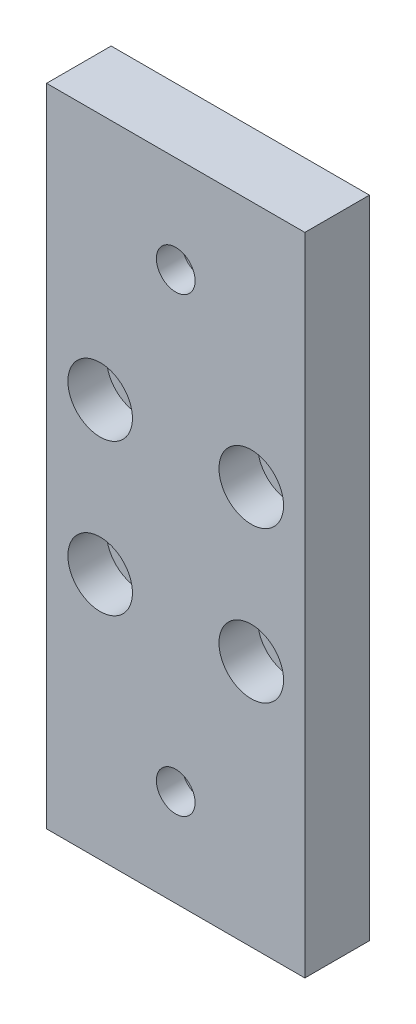
ISO-10303-21;
HEADER;
FILE_DESCRIPTION(('STEP AP214'),'2;1');
FILE_NAME('part.step','',(''),(''),'','','');
FILE_SCHEMA(('AUTOMOTIVE_DESIGN { 1 0 10303 214 1 1 1 1 }'));
ENDSEC;
DATA;
#1=APPLICATION_CONTEXT('core data for automotive mechanical design processes');
#2=APPLICATION_PROTOCOL_DEFINITION('international standard','automotive_design',2000,#1);
#3=PRODUCT_CONTEXT('',#1,'mechanical');
#4=PRODUCT('Part','Part','',(#3));
#5=PRODUCT_RELATED_PRODUCT_CATEGORY('part','',(#4));
#6=PRODUCT_DEFINITION_FORMATION('','',#4);
#7=PRODUCT_DEFINITION_CONTEXT('part definition',#1,'design');
#8=PRODUCT_DEFINITION('design','',#6,#7);
#9=PRODUCT_DEFINITION_SHAPE('','',#8);
#10=(LENGTH_UNIT() NAMED_UNIT(*) SI_UNIT(.MILLI.,.METRE.));
#11=(NAMED_UNIT(*) PLANE_ANGLE_UNIT() SI_UNIT($,.RADIAN.));
#12=(NAMED_UNIT(*) SI_UNIT($,.STERADIAN.) SOLID_ANGLE_UNIT());
#13=UNCERTAINTY_MEASURE_WITH_UNIT(LENGTH_MEASURE(1.E-05),#10,'distance_accuracy_value','');
#14=(GEOMETRIC_REPRESENTATION_CONTEXT(3) GLOBAL_UNCERTAINTY_ASSIGNED_CONTEXT((#13)) GLOBAL_UNIT_ASSIGNED_CONTEXT((#10,
#11,#12)) REPRESENTATION_CONTEXT('',''));
#15=CARTESIAN_POINT('',(0.,0.,0.));
#16=DIRECTION('',(0.,0.,1.));
#17=DIRECTION('',(1.,0.,0.));
#18=AXIS2_PLACEMENT_3D('',#15,#16,#17);
#19=CARTESIAN_POINT('',(31.7,61.7,-30.));
#20=DIRECTION('',(0.,0.,1.));
#21=DIRECTION('',(1.,0.,0.));
#22=AXIS2_PLACEMENT_3D('',#19,#20,#21);
#23=CYLINDRICAL_SURFACE('',#22,2.5);
#24=CARTESIAN_POINT('',(31.7,61.7,0.));
#25=DIRECTION('',(0.,0.,1.));
#26=DIRECTION('',(1.,0.,0.));
#27=AXIS2_PLACEMENT_3D('',#24,#25,#26);
#28=CIRCLE('',#27,2.5);
#29=CARTESIAN_POINT('',(34.2,61.7,0.));
#30=VERTEX_POINT('',#29);
#31=EDGE_CURVE('E132',#30,#30,#28,.T.);
#32=ORIENTED_EDGE('',*,*,#31,.F.);
#33=EDGE_LOOP('',(#32));
#34=FACE_BOUND('',#33,.T.);
#35=CARTESIAN_POINT('',(31.7,61.7,4.));
#36=DIRECTION('',(0.,0.,1.));
#37=DIRECTION('',(1.,0.,0.));
#38=AXIS2_PLACEMENT_3D('',#35,#36,#37);
#39=CIRCLE('',#38,2.5);
#40=CARTESIAN_POINT('',(34.2,61.7,4.));
#41=VERTEX_POINT('',#40);
#42=EDGE_CURVE('E49',#41,#41,#39,.F.);
#43=ORIENTED_EDGE('',*,*,#42,.F.);
#44=EDGE_LOOP('',(#43));
#45=FACE_BOUND('',#44,.T.);
#46=ADVANCED_FACE('F45',(#34,#45),#23,.F.);
#47=CARTESIAN_POINT('',(8.30000000000001,38.3,-30.));
#48=DIRECTION('',(0.,0.,1.));
#49=DIRECTION('',(1.,0.,0.));
#50=AXIS2_PLACEMENT_3D('',#47,#48,#49);
#51=CYLINDRICAL_SURFACE('',#50,2.5);
#52=CARTESIAN_POINT('',(8.30000000000001,38.3,0.));
#53=DIRECTION('',(0.,0.,1.));
#54=DIRECTION('',(1.,0.,0.));
#55=AXIS2_PLACEMENT_3D('',#52,#53,#54);
#56=CIRCLE('',#55,2.5);
#57=CARTESIAN_POINT('',(10.8,38.3,0.));
#58=VERTEX_POINT('',#57);
#59=EDGE_CURVE('E136',#58,#58,#56,.T.);
#60=ORIENTED_EDGE('',*,*,#59,.F.);
#61=EDGE_LOOP('',(#60));
#62=FACE_BOUND('',#61,.T.);
#63=CARTESIAN_POINT('',(8.30000000000001,38.3,4.));
#64=DIRECTION('',(0.,0.,1.));
#65=DIRECTION('',(1.,0.,0.));
#66=AXIS2_PLACEMENT_3D('',#63,#64,#65);
#67=CIRCLE('',#66,2.5);
#68=CARTESIAN_POINT('',(10.8,38.3,4.));
#69=VERTEX_POINT('',#68);
#70=EDGE_CURVE('E155',#69,#69,#67,.F.);
#71=ORIENTED_EDGE('',*,*,#70,.F.);
#72=EDGE_LOOP('',(#71));
#73=FACE_BOUND('',#72,.T.);
#74=ADVANCED_FACE('F167',(#62,#73),#51,.F.);
#75=CARTESIAN_POINT('',(31.7,38.3,-30.));
#76=DIRECTION('',(0.,0.,1.));
#77=DIRECTION('',(1.,0.,0.));
#78=AXIS2_PLACEMENT_3D('',#75,#76,#77);
#79=CYLINDRICAL_SURFACE('',#78,2.5);
#80=CARTESIAN_POINT('',(31.7,38.3,0.));
#81=DIRECTION('',(0.,0.,1.));
#82=DIRECTION('',(1.,0.,0.));
#83=AXIS2_PLACEMENT_3D('',#80,#81,#82);
#84=CIRCLE('',#83,2.5);
#85=CARTESIAN_POINT('',(34.2,38.3,0.));
#86=VERTEX_POINT('',#85);
#87=EDGE_CURVE('E140',#86,#86,#84,.T.);
#88=ORIENTED_EDGE('',*,*,#87,.F.);
#89=EDGE_LOOP('',(#88));
#90=FACE_BOUND('',#89,.T.);
#91=CARTESIAN_POINT('',(31.7,38.3,4.));
#92=DIRECTION('',(0.,0.,1.));
#93=DIRECTION('',(1.,0.,0.));
#94=AXIS2_PLACEMENT_3D('',#91,#92,#93);
#95=CIRCLE('',#94,2.5);
#96=CARTESIAN_POINT('',(34.2,38.3,4.));
#97=VERTEX_POINT('',#96);
#98=EDGE_CURVE('E151',#97,#97,#95,.F.);
#99=ORIENTED_EDGE('',*,*,#98,.F.);
#100=EDGE_LOOP('',(#99));
#101=FACE_BOUND('',#100,.T.);
#102=ADVANCED_FACE('F174',(#90,#101),#79,.F.);
#103=CARTESIAN_POINT('',(8.3,61.7,-30.));
#104=DIRECTION('',(0.,0.,1.));
#105=DIRECTION('',(1.,0.,0.));
#106=AXIS2_PLACEMENT_3D('',#103,#104,#105);
#107=CYLINDRICAL_SURFACE('',#106,2.5);
#108=CARTESIAN_POINT('',(8.3,61.7,0.));
#109=DIRECTION('',(0.,0.,1.));
#110=DIRECTION('',(1.,0.,0.));
#111=AXIS2_PLACEMENT_3D('',#108,#109,#110);
#112=CIRCLE('',#111,2.5);
#113=CARTESIAN_POINT('',(10.8,61.7,0.));
#114=VERTEX_POINT('',#113);
#115=EDGE_CURVE('E121',#114,#114,#112,.T.);
#116=ORIENTED_EDGE('',*,*,#115,.F.);
#117=EDGE_LOOP('',(#116));
#118=FACE_BOUND('',#117,.T.);
#119=CARTESIAN_POINT('',(8.3,61.7,4.));
#120=DIRECTION('',(0.,0.,1.));
#121=DIRECTION('',(1.,0.,0.));
#122=AXIS2_PLACEMENT_3D('',#119,#120,#121);
#123=CIRCLE('',#122,2.5);
#124=CARTESIAN_POINT('',(10.8,61.7,4.));
#125=VERTEX_POINT('',#124);
#126=EDGE_CURVE('E147',#125,#125,#123,.F.);
#127=ORIENTED_EDGE('',*,*,#126,.F.);
#128=EDGE_LOOP('',(#127));
#129=FACE_BOUND('',#128,.T.);
#130=ADVANCED_FACE('F196',(#118,#129),#107,.F.);
#131=CARTESIAN_POINT('',(0.,100.,10.));
#132=DIRECTION('',(1.,0.,0.));
#133=DIRECTION('',(0.,1.,0.));
#134=AXIS2_PLACEMENT_3D('',#131,#132,#133);
#135=PLANE('',#134);
#136=DIRECTION('',(0.,-1.,0.));
#137=VECTOR('',#136,1.);
#138=CARTESIAN_POINT('',(0.,100.,0.));
#139=LINE('',#138,#137);
#140=CARTESIAN_POINT('',(0.,100.,0.));
#141=VERTEX_POINT('',#140);
#142=CARTESIAN_POINT('',(0.,0.,0.));
#143=VERTEX_POINT('',#142);
#144=EDGE_CURVE('E117',#141,#143,#139,.T.);
#145=ORIENTED_EDGE('',*,*,#144,.T.);
#146=DIRECTION('',(0.,0.,-1.));
#147=VECTOR('',#146,1.);
#148=CARTESIAN_POINT('',(0.,0.,10.));
#149=LINE('',#148,#147);
#150=CARTESIAN_POINT('',(0.,0.,10.));
#151=VERTEX_POINT('',#150);
#152=EDGE_CURVE('E11',#151,#143,#149,.T.);
#153=ORIENTED_EDGE('',*,*,#152,.F.);
#154=DIRECTION('',(0.,-1.,0.));
#155=VECTOR('',#154,1.);
#156=CARTESIAN_POINT('',(0.,100.,10.));
#157=LINE('',#156,#155);
#158=CARTESIAN_POINT('',(0.,100.,10.));
#159=VERTEX_POINT('',#158);
#160=EDGE_CURVE('E100',#159,#151,#157,.T.);
#161=ORIENTED_EDGE('',*,*,#160,.F.);
#162=DIRECTION('',(0.,0.,-1.));
#163=VECTOR('',#162,1.);
#164=CARTESIAN_POINT('',(0.,100.,10.));
#165=LINE('',#164,#163);
#166=EDGE_CURVE('E113',#159,#141,#165,.T.);
#167=ORIENTED_EDGE('',*,*,#166,.T.);
#168=EDGE_LOOP('',(#145,#153,#161,#167));
#169=FACE_BOUND('',#168,.T.);
#170=ADVANCED_FACE('F47',(#169),#135,.F.);
#171=CARTESIAN_POINT('',(0.,0.,10.));
#172=DIRECTION('',(0.,1.,0.));
#173=DIRECTION('',(0.,0.,1.));
#174=AXIS2_PLACEMENT_3D('',#171,#172,#173);
#175=PLANE('',#174);
#176=DIRECTION('',(1.,0.,0.));
#177=VECTOR('',#176,1.);
#178=CARTESIAN_POINT('',(0.,0.,0.));
#179=LINE('',#178,#177);
#180=CARTESIAN_POINT('',(40.,0.,0.));
#181=VERTEX_POINT('',#180);
#182=EDGE_CURVE('E105',#143,#181,#179,.T.);
#183=ORIENTED_EDGE('',*,*,#182,.T.);
#184=DIRECTION('',(0.,0.,-1.));
#185=VECTOR('',#184,1.);
#186=CARTESIAN_POINT('',(40.,0.,10.));
#187=LINE('',#186,#185);
#188=CARTESIAN_POINT('',(40.,0.,10.));
#189=VERTEX_POINT('',#188);
#190=EDGE_CURVE('E56',#189,#181,#187,.T.);
#191=ORIENTED_EDGE('',*,*,#190,.F.);
#192=DIRECTION('',(1.,0.,0.));
#193=VECTOR('',#192,1.);
#194=CARTESIAN_POINT('',(0.,0.,10.));
#195=LINE('',#194,#193);
#196=EDGE_CURVE('E95',#151,#189,#195,.T.);
#197=ORIENTED_EDGE('',*,*,#196,.F.);
#198=ORIENTED_EDGE('',*,*,#152,.T.);
#199=EDGE_LOOP('',(#183,#191,#197,#198));
#200=FACE_BOUND('',#199,.T.);
#201=ADVANCED_FACE('F104',(#200),#175,.F.);
#202=CARTESIAN_POINT('',(40.,0.,10.));
#203=DIRECTION('',(-1.,0.,0.));
#204=DIRECTION('',(0.,-1.,0.));
#205=AXIS2_PLACEMENT_3D('',#202,#203,#204);
#206=PLANE('',#205);
#207=DIRECTION('',(0.,1.,0.));
#208=VECTOR('',#207,1.);
#209=CARTESIAN_POINT('',(40.,0.,0.));
#210=LINE('',#209,#208);
#211=CARTESIAN_POINT('',(40.,100.,0.));
#212=VERTEX_POINT('',#211);
#213=EDGE_CURVE('E82',#181,#212,#210,.T.);
#214=ORIENTED_EDGE('',*,*,#213,.T.);
#215=DIRECTION('',(0.,0.,-1.));
#216=VECTOR('',#215,1.);
#217=CARTESIAN_POINT('',(40.,100.,10.));
#218=LINE('',#217,#216);
#219=CARTESIAN_POINT('',(40.,100.,10.));
#220=VERTEX_POINT('',#219);
#221=EDGE_CURVE('E107',#220,#212,#218,.T.);
#222=ORIENTED_EDGE('',*,*,#221,.F.);
#223=DIRECTION('',(0.,1.,0.));
#224=VECTOR('',#223,1.);
#225=CARTESIAN_POINT('',(40.,0.,10.));
#226=LINE('',#225,#224);
#227=EDGE_CURVE('E98',#189,#220,#226,.T.);
#228=ORIENTED_EDGE('',*,*,#227,.F.);
#229=ORIENTED_EDGE('',*,*,#190,.T.);
#230=EDGE_LOOP('',(#214,#222,#228,#229));
#231=FACE_BOUND('',#230,.T.);
#232=ADVANCED_FACE('F109',(#231),#206,.F.);
#233=CARTESIAN_POINT('',(0.,100.,10.));
#234=DIRECTION('',(0.,-1.,0.));
#235=DIRECTION('',(0.,0.,-1.));
#236=AXIS2_PLACEMENT_3D('',#233,#234,#235);
#237=PLANE('',#236);
#238=DIRECTION('',(-1.,0.,0.));
#239=VECTOR('',#238,1.);
#240=CARTESIAN_POINT('',(0.,100.,0.));
#241=LINE('',#240,#239);
#242=EDGE_CURVE('E88',#212,#141,#241,.T.);
#243=ORIENTED_EDGE('',*,*,#242,.T.);
#244=ORIENTED_EDGE('',*,*,#166,.F.);
#245=DIRECTION('',(-1.,0.,0.));
#246=VECTOR('',#245,1.);
#247=CARTESIAN_POINT('',(0.,100.,10.));
#248=LINE('',#247,#246);
#249=EDGE_CURVE('E65',#220,#159,#248,.T.);
#250=ORIENTED_EDGE('',*,*,#249,.F.);
#251=ORIENTED_EDGE('',*,*,#221,.T.);
#252=EDGE_LOOP('',(#243,#244,#250,#251));
#253=FACE_BOUND('',#252,.T.);
#254=ADVANCED_FACE('F184',(#253),#237,.F.);
#255=CARTESIAN_POINT('',(0.,0.,10.));
#256=DIRECTION('',(0.,0.,1.));
#257=DIRECTION('',(1.,0.,0.));
#258=AXIS2_PLACEMENT_3D('',#255,#256,#257);
#259=PLANE('',#258);
#260=CARTESIAN_POINT('',(20.,15.,10.));
#261=DIRECTION('',(0.,0.,-1.));
#262=DIRECTION('',(-1.,0.,0.));
#263=AXIS2_PLACEMENT_3D('',#260,#261,#262);
#264=CIRCLE('',#263,3.);
#265=CARTESIAN_POINT('',(17.,15.,10.));
#266=VERTEX_POINT('',#265);
#267=EDGE_CURVE('E243',#266,#266,#264,.T.);
#268=ORIENTED_EDGE('',*,*,#267,.T.);
#269=EDGE_LOOP('',(#268));
#270=FACE_BOUND('',#269,.T.);
#271=CARTESIAN_POINT('',(20.,85.,10.));
#272=DIRECTION('',(0.,0.,-1.));
#273=DIRECTION('',(-1.,0.,0.));
#274=AXIS2_PLACEMENT_3D('',#271,#272,#273);
#275=CIRCLE('',#274,3.);
#276=CARTESIAN_POINT('',(17.,85.,10.));
#277=VERTEX_POINT('',#276);
#278=EDGE_CURVE('E254',#277,#277,#275,.T.);
#279=ORIENTED_EDGE('',*,*,#278,.T.);
#280=EDGE_LOOP('',(#279));
#281=FACE_BOUND('',#280,.T.);
#282=CARTESIAN_POINT('',(8.30000000000001,38.3,10.));
#283=DIRECTION('',(0.,0.,1.));
#284=DIRECTION('',(1.,0.,0.));
#285=AXIS2_PLACEMENT_3D('',#282,#283,#284);
#286=CIRCLE('',#285,5.);
#287=CARTESIAN_POINT('',(13.3,38.3,10.));
#288=VERTEX_POINT('',#287);
#289=EDGE_CURVE('E218',#288,#288,#286,.T.);
#290=ORIENTED_EDGE('',*,*,#289,.F.);
#291=EDGE_LOOP('',(#290));
#292=FACE_BOUND('',#291,.T.);
#293=CARTESIAN_POINT('',(31.7,38.3,10.));
#294=DIRECTION('',(0.,0.,1.));
#295=DIRECTION('',(1.,0.,0.));
#296=AXIS2_PLACEMENT_3D('',#293,#294,#295);
#297=CIRCLE('',#296,5.);
#298=CARTESIAN_POINT('',(36.7,38.3,10.));
#299=VERTEX_POINT('',#298);
#300=EDGE_CURVE('E227',#299,#299,#297,.T.);
#301=ORIENTED_EDGE('',*,*,#300,.F.);
#302=EDGE_LOOP('',(#301));
#303=FACE_BOUND('',#302,.T.);
#304=CARTESIAN_POINT('',(31.7,61.7,10.));
#305=DIRECTION('',(0.,0.,1.));
#306=DIRECTION('',(1.,0.,0.));
#307=AXIS2_PLACEMENT_3D('',#304,#305,#306);
#308=CIRCLE('',#307,5.);
#309=CARTESIAN_POINT('',(36.7,61.7,10.));
#310=VERTEX_POINT('',#309);
#311=EDGE_CURVE('E210',#310,#310,#308,.T.);
#312=ORIENTED_EDGE('',*,*,#311,.F.);
#313=EDGE_LOOP('',(#312));
#314=FACE_BOUND('',#313,.T.);
#315=CARTESIAN_POINT('',(8.3,61.7,10.));
#316=DIRECTION('',(0.,0.,1.));
#317=DIRECTION('',(1.,0.,0.));
#318=AXIS2_PLACEMENT_3D('',#315,#316,#317);
#319=CIRCLE('',#318,5.);
#320=CARTESIAN_POINT('',(13.3,61.7,10.));
#321=VERTEX_POINT('',#320);
#322=EDGE_CURVE('E206',#321,#321,#319,.T.);
#323=ORIENTED_EDGE('',*,*,#322,.F.);
#324=EDGE_LOOP('',(#323));
#325=FACE_BOUND('',#324,.T.);
#326=ORIENTED_EDGE('',*,*,#160,.T.);
#327=ORIENTED_EDGE('',*,*,#196,.T.);
#328=ORIENTED_EDGE('',*,*,#227,.T.);
#329=ORIENTED_EDGE('',*,*,#249,.T.);
#330=EDGE_LOOP('',(#326,#327,#328,#329));
#331=FACE_BOUND('',#330,.T.);
#332=ADVANCED_FACE('F96',(#270,#281,#292,#303,#314,#325,#331),#259,.T.);
#333=CARTESIAN_POINT('',(0.,0.,0.));
#334=DIRECTION('',(0.,0.,1.));
#335=DIRECTION('',(1.,0.,0.));
#336=AXIS2_PLACEMENT_3D('',#333,#334,#335);
#337=PLANE('',#336);
#338=CARTESIAN_POINT('',(20.,85.,0.));
#339=DIRECTION('',(0.,0.,-1.));
#340=DIRECTION('',(-1.,0.,0.));
#341=AXIS2_PLACEMENT_3D('',#338,#339,#340);
#342=CIRCLE('',#341,5.);
#343=CARTESIAN_POINT('',(15.,85.,0.));
#344=VERTEX_POINT('',#343);
#345=EDGE_CURVE('E247',#344,#344,#342,.T.);
#346=ORIENTED_EDGE('',*,*,#345,.F.);
#347=EDGE_LOOP('',(#346));
#348=FACE_BOUND('',#347,.T.);
#349=CARTESIAN_POINT('',(20.,15.,0.));
#350=DIRECTION('',(0.,0.,-1.));
#351=DIRECTION('',(-1.,0.,0.));
#352=AXIS2_PLACEMENT_3D('',#349,#350,#351);
#353=CIRCLE('',#352,5.);
#354=CARTESIAN_POINT('',(15.,15.,0.));
#355=VERTEX_POINT('',#354);
#356=EDGE_CURVE('E242',#355,#355,#353,.T.);
#357=ORIENTED_EDGE('',*,*,#356,.F.);
#358=EDGE_LOOP('',(#357));
#359=FACE_BOUND('',#358,.T.);
#360=ORIENTED_EDGE('',*,*,#115,.T.);
#361=EDGE_LOOP('',(#360));
#362=FACE_BOUND('',#361,.T.);
#363=ORIENTED_EDGE('',*,*,#87,.T.);
#364=EDGE_LOOP('',(#363));
#365=FACE_BOUND('',#364,.T.);
#366=ORIENTED_EDGE('',*,*,#59,.T.);
#367=EDGE_LOOP('',(#366));
#368=FACE_BOUND('',#367,.T.);
#369=ORIENTED_EDGE('',*,*,#31,.T.);
#370=EDGE_LOOP('',(#369));
#371=FACE_BOUND('',#370,.T.);
#372=ORIENTED_EDGE('',*,*,#144,.F.);
#373=ORIENTED_EDGE('',*,*,#242,.F.);
#374=ORIENTED_EDGE('',*,*,#213,.F.);
#375=ORIENTED_EDGE('',*,*,#182,.F.);
#376=EDGE_LOOP('',(#372,#373,#374,#375));
#377=FACE_BOUND('',#376,.T.);
#378=ADVANCED_FACE('F183',(#348,#359,#362,#365,#368,#371,#377),#337,.F.);
#379=CARTESIAN_POINT('',(8.3,61.7,4.));
#380=DIRECTION('',(0.,0.,1.));
#381=DIRECTION('',(1.,0.,0.));
#382=AXIS2_PLACEMENT_3D('',#379,#380,#381);
#383=PLANE('',#382);
#384=CARTESIAN_POINT('',(8.3,61.7,4.));
#385=DIRECTION('',(0.,0.,1.));
#386=DIRECTION('',(1.,0.,0.));
#387=AXIS2_PLACEMENT_3D('',#384,#385,#386);
#388=CIRCLE('',#387,5.);
#389=CARTESIAN_POINT('',(13.3,61.7,4.));
#390=VERTEX_POINT('',#389);
#391=EDGE_CURVE('E152',#390,#390,#388,.T.);
#392=ORIENTED_EDGE('',*,*,#391,.T.);
#393=EDGE_LOOP('',(#392));
#394=FACE_BOUND('',#393,.T.);
#395=ORIENTED_EDGE('',*,*,#126,.T.);
#396=EDGE_LOOP('',(#395));
#397=FACE_BOUND('',#396,.T.);
#398=ADVANCED_FACE('F188',(#394,#397),#383,.T.);
#399=CARTESIAN_POINT('',(8.3,61.7,4.));
#400=DIRECTION('',(0.,0.,1.));
#401=DIRECTION('',(1.,0.,0.));
#402=AXIS2_PLACEMENT_3D('',#399,#400,#401);
#403=CYLINDRICAL_SURFACE('',#402,5.);
#404=ORIENTED_EDGE('',*,*,#391,.F.);
#405=EDGE_LOOP('',(#404));
#406=FACE_BOUND('',#405,.T.);
#407=ORIENTED_EDGE('',*,*,#322,.T.);
#408=EDGE_LOOP('',(#407));
#409=FACE_BOUND('',#408,.T.);
#410=ADVANCED_FACE('F308',(#406,#409),#403,.F.);
#411=CARTESIAN_POINT('',(31.7,38.3,4.));
#412=DIRECTION('',(0.,0.,1.));
#413=DIRECTION('',(1.,0.,0.));
#414=AXIS2_PLACEMENT_3D('',#411,#412,#413);
#415=PLANE('',#414);
#416=CARTESIAN_POINT('',(31.7,38.3,4.));
#417=DIRECTION('',(0.,0.,1.));
#418=DIRECTION('',(1.,0.,0.));
#419=AXIS2_PLACEMENT_3D('',#416,#417,#418);
#420=CIRCLE('',#419,5.);
#421=CARTESIAN_POINT('',(36.7,38.3,4.));
#422=VERTEX_POINT('',#421);
#423=EDGE_CURVE('E223',#422,#422,#420,.T.);
#424=ORIENTED_EDGE('',*,*,#423,.T.);
#425=EDGE_LOOP('',(#424));
#426=FACE_BOUND('',#425,.T.);
#427=ORIENTED_EDGE('',*,*,#98,.T.);
#428=EDGE_LOOP('',(#427));
#429=FACE_BOUND('',#428,.T.);
#430=ADVANCED_FACE('F305',(#426,#429),#415,.T.);
#431=CARTESIAN_POINT('',(31.7,38.3,4.));
#432=DIRECTION('',(0.,0.,1.));
#433=DIRECTION('',(1.,0.,0.));
#434=AXIS2_PLACEMENT_3D('',#431,#432,#433);
#435=CYLINDRICAL_SURFACE('',#434,5.);
#436=ORIENTED_EDGE('',*,*,#423,.F.);
#437=EDGE_LOOP('',(#436));
#438=FACE_BOUND('',#437,.T.);
#439=ORIENTED_EDGE('',*,*,#300,.T.);
#440=EDGE_LOOP('',(#439));
#441=FACE_BOUND('',#440,.T.);
#442=ADVANCED_FACE('F307',(#438,#441),#435,.F.);
#443=CARTESIAN_POINT('',(8.30000000000001,38.3,4.));
#444=DIRECTION('',(0.,0.,1.));
#445=DIRECTION('',(1.,0.,0.));
#446=AXIS2_PLACEMENT_3D('',#443,#444,#445);
#447=PLANE('',#446);
#448=CARTESIAN_POINT('',(8.30000000000001,38.3,4.));
#449=DIRECTION('',(0.,0.,1.));
#450=DIRECTION('',(1.,0.,0.));
#451=AXIS2_PLACEMENT_3D('',#448,#449,#450);
#452=CIRCLE('',#451,5.);
#453=CARTESIAN_POINT('',(13.3,38.3,4.));
#454=VERTEX_POINT('',#453);
#455=EDGE_CURVE('E214',#454,#454,#452,.T.);
#456=ORIENTED_EDGE('',*,*,#455,.T.);
#457=EDGE_LOOP('',(#456));
#458=FACE_BOUND('',#457,.T.);
#459=ORIENTED_EDGE('',*,*,#70,.T.);
#460=EDGE_LOOP('',(#459));
#461=FACE_BOUND('',#460,.T.);
#462=ADVANCED_FACE('F315',(#458,#461),#447,.T.);
#463=CARTESIAN_POINT('',(8.30000000000001,38.3,4.));
#464=DIRECTION('',(0.,0.,1.));
#465=DIRECTION('',(1.,0.,0.));
#466=AXIS2_PLACEMENT_3D('',#463,#464,#465);
#467=CYLINDRICAL_SURFACE('',#466,5.);
#468=ORIENTED_EDGE('',*,*,#455,.F.);
#469=EDGE_LOOP('',(#468));
#470=FACE_BOUND('',#469,.T.);
#471=ORIENTED_EDGE('',*,*,#289,.T.);
#472=EDGE_LOOP('',(#471));
#473=FACE_BOUND('',#472,.T.);
#474=ADVANCED_FACE('F322',(#470,#473),#467,.F.);
#475=CARTESIAN_POINT('',(31.7,61.7,4.));
#476=DIRECTION('',(0.,0.,1.));
#477=DIRECTION('',(1.,0.,0.));
#478=AXIS2_PLACEMENT_3D('',#475,#476,#477);
#479=PLANE('',#478);
#480=CARTESIAN_POINT('',(31.7,61.7,4.));
#481=DIRECTION('',(0.,0.,1.));
#482=DIRECTION('',(1.,0.,0.));
#483=AXIS2_PLACEMENT_3D('',#480,#481,#482);
#484=CIRCLE('',#483,5.);
#485=CARTESIAN_POINT('',(36.7,61.7,4.));
#486=VERTEX_POINT('',#485);
#487=EDGE_CURVE('E231',#486,#486,#484,.T.);
#488=ORIENTED_EDGE('',*,*,#487,.T.);
#489=EDGE_LOOP('',(#488));
#490=FACE_BOUND('',#489,.T.);
#491=ORIENTED_EDGE('',*,*,#42,.T.);
#492=EDGE_LOOP('',(#491));
#493=FACE_BOUND('',#492,.T.);
#494=ADVANCED_FACE('F164',(#490,#493),#479,.T.);
#495=CARTESIAN_POINT('',(31.7,61.7,4.));
#496=DIRECTION('',(0.,0.,1.));
#497=DIRECTION('',(1.,0.,0.));
#498=AXIS2_PLACEMENT_3D('',#495,#496,#497);
#499=CYLINDRICAL_SURFACE('',#498,5.);
#500=ORIENTED_EDGE('',*,*,#487,.F.);
#501=EDGE_LOOP('',(#500));
#502=FACE_BOUND('',#501,.T.);
#503=ORIENTED_EDGE('',*,*,#311,.T.);
#504=EDGE_LOOP('',(#503));
#505=FACE_BOUND('',#504,.T.);
#506=ADVANCED_FACE('F288',(#502,#505),#499,.F.);
#507=CARTESIAN_POINT('',(20.,15.,6.));
#508=DIRECTION('',(0.,0.,-1.));
#509=DIRECTION('',(-1.,0.,0.));
#510=AXIS2_PLACEMENT_3D('',#507,#508,#509);
#511=CYLINDRICAL_SURFACE('',#510,5.);
#512=CARTESIAN_POINT('',(20.,15.,6.));
#513=DIRECTION('',(0.,0.,-1.));
#514=DIRECTION('',(-1.,0.,0.));
#515=AXIS2_PLACEMENT_3D('',#512,#513,#514);
#516=CIRCLE('',#515,5.);
#517=CARTESIAN_POINT('',(15.,15.,6.));
#518=VERTEX_POINT('',#517);
#519=EDGE_CURVE('E238',#518,#518,#516,.T.);
#520=ORIENTED_EDGE('',*,*,#519,.F.);
#521=EDGE_LOOP('',(#520));
#522=FACE_BOUND('',#521,.T.);
#523=ORIENTED_EDGE('',*,*,#356,.T.);
#524=EDGE_LOOP('',(#523));
#525=FACE_BOUND('',#524,.T.);
#526=ADVANCED_FACE('F282',(#522,#525),#511,.F.);
#527=CARTESIAN_POINT('',(20.,15.,6.));
#528=DIRECTION('',(0.,0.,-1.));
#529=DIRECTION('',(-1.,0.,0.));
#530=AXIS2_PLACEMENT_3D('',#527,#528,#529);
#531=PLANE('',#530);
#532=CARTESIAN_POINT('',(20.,15.,6.));
#533=DIRECTION('',(0.,0.,-1.));
#534=DIRECTION('',(-1.,0.,0.));
#535=AXIS2_PLACEMENT_3D('',#532,#533,#534);
#536=CIRCLE('',#535,3.);
#537=CARTESIAN_POINT('',(17.,15.,6.));
#538=VERTEX_POINT('',#537);
#539=EDGE_CURVE('E262',#538,#538,#536,.T.);
#540=ORIENTED_EDGE('',*,*,#539,.F.);
#541=EDGE_LOOP('',(#540));
#542=FACE_BOUND('',#541,.T.);
#543=ORIENTED_EDGE('',*,*,#519,.T.);
#544=EDGE_LOOP('',(#543));
#545=FACE_BOUND('',#544,.T.);
#546=ADVANCED_FACE('F278',(#542,#545),#531,.T.);
#547=CARTESIAN_POINT('',(20.,85.,6.));
#548=DIRECTION('',(0.,0.,-1.));
#549=DIRECTION('',(-1.,0.,0.));
#550=AXIS2_PLACEMENT_3D('',#547,#548,#549);
#551=CYLINDRICAL_SURFACE('',#550,5.);
#552=CARTESIAN_POINT('',(20.,85.,6.));
#553=DIRECTION('',(0.,0.,-1.));
#554=DIRECTION('',(-1.,0.,0.));
#555=AXIS2_PLACEMENT_3D('',#552,#553,#554);
#556=CIRCLE('',#555,5.);
#557=CARTESIAN_POINT('',(15.,85.,6.));
#558=VERTEX_POINT('',#557);
#559=EDGE_CURVE('E219',#558,#558,#556,.T.);
#560=ORIENTED_EDGE('',*,*,#559,.F.);
#561=EDGE_LOOP('',(#560));
#562=FACE_BOUND('',#561,.T.);
#563=ORIENTED_EDGE('',*,*,#345,.T.);
#564=EDGE_LOOP('',(#563));
#565=FACE_BOUND('',#564,.T.);
#566=ADVANCED_FACE('F281',(#562,#565),#551,.F.);
#567=CARTESIAN_POINT('',(20.,85.,6.));
#568=DIRECTION('',(0.,0.,-1.));
#569=DIRECTION('',(-1.,0.,0.));
#570=AXIS2_PLACEMENT_3D('',#567,#568,#569);
#571=PLANE('',#570);
#572=CARTESIAN_POINT('',(20.,85.,6.));
#573=DIRECTION('',(0.,0.,-1.));
#574=DIRECTION('',(-1.,0.,0.));
#575=AXIS2_PLACEMENT_3D('',#572,#573,#574);
#576=CIRCLE('',#575,3.);
#577=CARTESIAN_POINT('',(17.,85.,6.));
#578=VERTEX_POINT('',#577);
#579=EDGE_CURVE('E258',#578,#578,#576,.T.);
#580=ORIENTED_EDGE('',*,*,#579,.F.);
#581=EDGE_LOOP('',(#580));
#582=FACE_BOUND('',#581,.T.);
#583=ORIENTED_EDGE('',*,*,#559,.T.);
#584=EDGE_LOOP('',(#583));
#585=FACE_BOUND('',#584,.T.);
#586=ADVANCED_FACE('F410',(#582,#585),#571,.T.);
#587=CARTESIAN_POINT('',(20.,85.,10.));
#588=DIRECTION('',(0.,0.,-1.));
#589=DIRECTION('',(-1.,0.,0.));
#590=AXIS2_PLACEMENT_3D('',#587,#588,#589);
#591=CYLINDRICAL_SURFACE('',#590,3.);
#592=ORIENTED_EDGE('',*,*,#278,.F.);
#593=EDGE_LOOP('',(#592));
#594=FACE_BOUND('',#593,.T.);
#595=ORIENTED_EDGE('',*,*,#579,.T.);
#596=EDGE_LOOP('',(#595));
#597=FACE_BOUND('',#596,.T.);
#598=ADVANCED_FACE('F274',(#594,#597),#591,.F.);
#599=CARTESIAN_POINT('',(20.,15.,10.));
#600=DIRECTION('',(0.,0.,-1.));
#601=DIRECTION('',(-1.,0.,0.));
#602=AXIS2_PLACEMENT_3D('',#599,#600,#601);
#603=CYLINDRICAL_SURFACE('',#602,3.);
#604=ORIENTED_EDGE('',*,*,#267,.F.);
#605=EDGE_LOOP('',(#604));
#606=FACE_BOUND('',#605,.T.);
#607=ORIENTED_EDGE('',*,*,#539,.T.);
#608=EDGE_LOOP('',(#607));
#609=FACE_BOUND('',#608,.T.);
#610=ADVANCED_FACE('F271',(#606,#609),#603,.F.);
#611=CLOSED_SHELL('',(#46,#74,#102,#130,#170,#201,#232,#254,#332,#378,#398,#410,#430,#442,#462,
#474,#494,#506,#526,#546,#566,#586,#598,#610));
#612=MANIFOLD_SOLID_BREP('B2',#611);
#613=ADVANCED_BREP_SHAPE_REPRESENTATION('',(#18,#612),#14);
#614=SHAPE_DEFINITION_REPRESENTATION(#9,#613);
ENDSEC;
END-ISO-10303-21;
